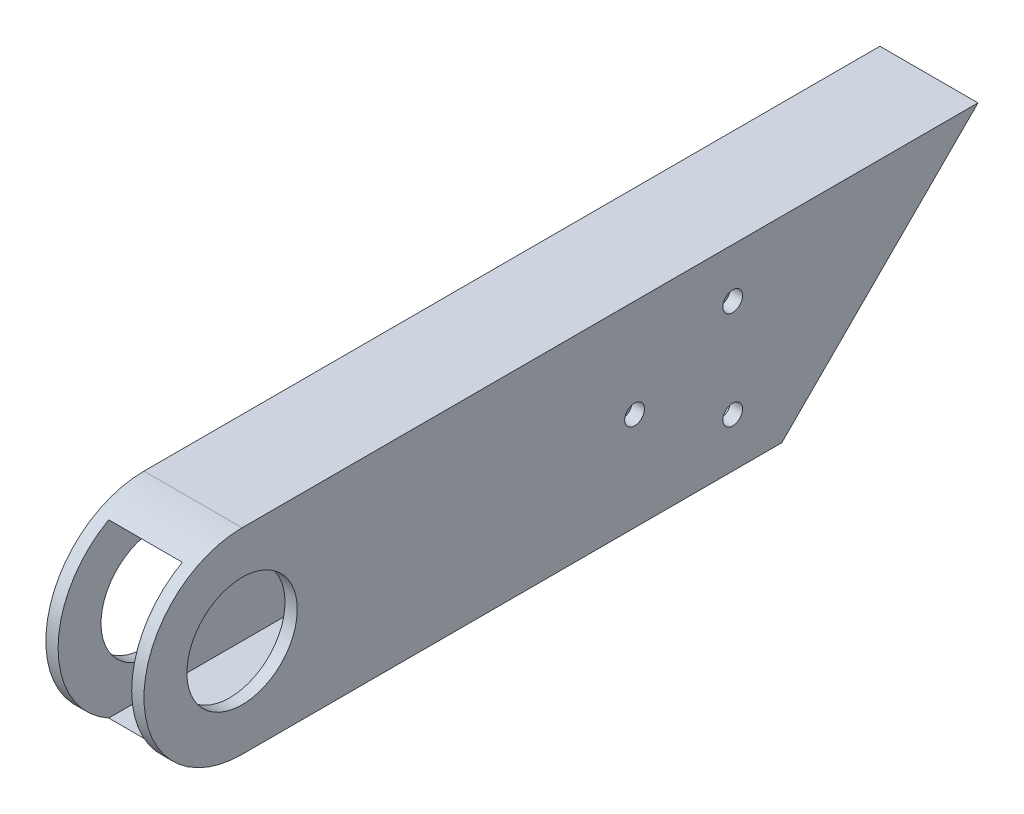
ISO-10303-21;
HEADER;
FILE_DESCRIPTION(('STEP AP214'),'2;1');
FILE_NAME('part.step','',(''),(''),'','','');
FILE_SCHEMA(('AUTOMOTIVE_DESIGN { 1 0 10303 214 1 1 1 1 }'));
ENDSEC;
DATA;
#1=APPLICATION_CONTEXT('core data for automotive mechanical design processes');
#2=APPLICATION_PROTOCOL_DEFINITION('international standard','automotive_design',2000,#1);
#3=PRODUCT_CONTEXT('',#1,'mechanical');
#4=PRODUCT('Part','Part','',(#3));
#5=PRODUCT_RELATED_PRODUCT_CATEGORY('part','',(#4));
#6=PRODUCT_DEFINITION_FORMATION('','',#4);
#7=PRODUCT_DEFINITION_CONTEXT('part definition',#1,'design');
#8=PRODUCT_DEFINITION('design','',#6,#7);
#9=PRODUCT_DEFINITION_SHAPE('','',#8);
#10=(LENGTH_UNIT() NAMED_UNIT(*) SI_UNIT(.MILLI.,.METRE.));
#11=(NAMED_UNIT(*) PLANE_ANGLE_UNIT() SI_UNIT($,.RADIAN.));
#12=(NAMED_UNIT(*) SI_UNIT($,.STERADIAN.) SOLID_ANGLE_UNIT());
#13=UNCERTAINTY_MEASURE_WITH_UNIT(LENGTH_MEASURE(1.E-05),#10,'distance_accuracy_value','');
#14=(GEOMETRIC_REPRESENTATION_CONTEXT(3) GLOBAL_UNCERTAINTY_ASSIGNED_CONTEXT((#13)) GLOBAL_UNIT_ASSIGNED_CONTEXT((#10,
#11,#12)) REPRESENTATION_CONTEXT('',''));
#15=CARTESIAN_POINT('',(0.,0.,0.));
#16=DIRECTION('',(0.,0.,1.));
#17=DIRECTION('',(1.,0.,0.));
#18=AXIS2_PLACEMENT_3D('',#15,#16,#17);
#19=CARTESIAN_POINT('',(-25.4,50.8,215.9));
#20=DIRECTION('',(1.,0.,0.));
#21=DIRECTION('',(0.,0.,-1.));
#22=AXIS2_PLACEMENT_3D('',#19,#20,#21);
#23=PLANE('',#22);
#24=CARTESIAN_POINT('',(-25.4,25.4,190.5));
#25=DIRECTION('',(1.,0.,0.));
#26=DIRECTION('',(0.,1.,0.));
#27=AXIS2_PLACEMENT_3D('',#24,#25,#26);
#28=CIRCLE('',#27,14.2875);
#29=CARTESIAN_POINT('',(-25.4,39.6875,190.5));
#30=VERTEX_POINT('',#29);
#31=EDGE_CURVE('E224',#30,#30,#28,.T.);
#32=ORIENTED_EDGE('',*,*,#31,.T.);
#33=EDGE_LOOP('',(#32));
#34=FACE_BOUND('',#33,.T.);
#35=CARTESIAN_POINT('',(-25.4,25.4,88.8999999999991));
#36=DIRECTION('',(1.,0.,0.));
#37=DIRECTION('',(0.,1.,0.));
#38=AXIS2_PLACEMENT_3D('',#35,#36,#37);
#39=CIRCLE('',#38,2.55270000000001);
#40=CARTESIAN_POINT('',(-25.4,27.9527,88.8999999999991));
#41=VERTEX_POINT('',#40);
#42=EDGE_CURVE('E140',#41,#41,#39,.T.);
#43=ORIENTED_EDGE('',*,*,#42,.T.);
#44=EDGE_LOOP('',(#43));
#45=FACE_BOUND('',#44,.T.);
#46=CARTESIAN_POINT('',(-25.4,12.7,63.4999999999991));
#47=DIRECTION('',(1.,0.,0.));
#48=DIRECTION('',(0.,1.,0.));
#49=AXIS2_PLACEMENT_3D('',#46,#47,#48);
#50=CIRCLE('',#49,2.55270000000001);
#51=CARTESIAN_POINT('',(-25.4,15.2527,63.4999999999991));
#52=VERTEX_POINT('',#51);
#53=EDGE_CURVE('E136',#52,#52,#50,.T.);
#54=ORIENTED_EDGE('',*,*,#53,.T.);
#55=EDGE_LOOP('',(#54));
#56=FACE_BOUND('',#55,.T.);
#57=CARTESIAN_POINT('',(-25.4,38.1,63.4999999999991));
#58=DIRECTION('',(1.,0.,0.));
#59=DIRECTION('',(0.,1.,0.));
#60=AXIS2_PLACEMENT_3D('',#57,#58,#59);
#61=CIRCLE('',#60,2.55270000000001);
#62=CARTESIAN_POINT('',(-25.4,40.6527,63.4999999999991));
#63=VERTEX_POINT('',#62);
#64=EDGE_CURVE('E131',#63,#63,#61,.T.);
#65=ORIENTED_EDGE('',*,*,#64,.T.);
#66=EDGE_LOOP('',(#65));
#67=FACE_BOUND('',#66,.T.);
#68=DIRECTION('',(0.,0.,-1.));
#69=VECTOR('',#68,1.);
#70=CARTESIAN_POINT('',(-25.4,0.,215.9));
#71=LINE('',#70,#69);
#72=CARTESIAN_POINT('',(-25.4,0.,190.5));
#73=VERTEX_POINT('',#72);
#74=CARTESIAN_POINT('',(-25.4,0.,50.7999999999991));
#75=VERTEX_POINT('',#74);
#76=EDGE_CURVE('E109',#73,#75,#71,.T.);
#77=ORIENTED_EDGE('',*,*,#76,.F.);
#78=CARTESIAN_POINT('',(-25.4,25.4,190.5));
#79=DIRECTION('',(-1.,0.,0.));
#80=DIRECTION('',(0.,-1.,0.));
#81=AXIS2_PLACEMENT_3D('',#78,#79,#80);
#82=CIRCLE('',#81,25.4);
#83=CARTESIAN_POINT('',(-25.4,50.8,190.5));
#84=VERTEX_POINT('',#83);
#85=EDGE_CURVE('E97',#73,#84,#82,.T.);
#86=ORIENTED_EDGE('',*,*,#85,.T.);
#87=DIRECTION('',(0.,0.,-1.));
#88=VECTOR('',#87,1.);
#89=CARTESIAN_POINT('',(-25.4,50.8,215.9));
#90=LINE('',#89,#88);
#91=CARTESIAN_POINT('',(-25.4,50.8,0.));
#92=VERTEX_POINT('',#91);
#93=EDGE_CURVE('E107',#84,#92,#90,.T.);
#94=ORIENTED_EDGE('',*,*,#93,.T.);
#95=DIRECTION('',(0.,-0.707106781186554,0.707106781186541));
#96=VECTOR('',#95,1.);
#97=CARTESIAN_POINT('',(-25.4,50.8,0.));
#98=LINE('',#97,#96);
#99=EDGE_CURVE('E171',#92,#75,#98,.T.);
#100=ORIENTED_EDGE('',*,*,#99,.T.);
#101=EDGE_LOOP('',(#77,#86,#94,#100));
#102=FACE_BOUND('',#101,.T.);
#103=ADVANCED_FACE('F33',(#34,#45,#56,#67,#102),#23,.F.);
#104=CARTESIAN_POINT('',(-25.4,0.,215.9));
#105=DIRECTION('',(0.,1.,0.));
#106=DIRECTION('',(0.,0.,1.));
#107=AXIS2_PLACEMENT_3D('',#104,#105,#106);
#108=PLANE('',#107);
#109=DIRECTION('',(1.,0.,0.));
#110=VECTOR('',#109,1.);
#111=CARTESIAN_POINT('',(-25.4,0.,190.5));
#112=LINE('',#111,#110);
#113=CARTESIAN_POINT('',(0.,0.,190.5));
#114=VERTEX_POINT('',#113);
#115=EDGE_CURVE('E102',#73,#114,#112,.T.);
#116=ORIENTED_EDGE('',*,*,#115,.F.);
#117=ORIENTED_EDGE('',*,*,#76,.T.);
#118=DIRECTION('',(1.,0.,0.));
#119=VECTOR('',#118,1.);
#120=CARTESIAN_POINT('',(-25.4,0.,50.7999999999991));
#121=LINE('',#120,#119);
#122=CARTESIAN_POINT('',(0.,0.,50.7999999999991));
#123=VERTEX_POINT('',#122);
#124=EDGE_CURVE('E173',#75,#123,#121,.T.);
#125=ORIENTED_EDGE('',*,*,#124,.T.);
#126=DIRECTION('',(0.,0.,-1.));
#127=VECTOR('',#126,1.);
#128=CARTESIAN_POINT('',(0.,0.,215.9));
#129=LINE('',#128,#127);
#130=EDGE_CURVE('E117',#114,#123,#129,.T.);
#131=ORIENTED_EDGE('',*,*,#130,.F.);
#132=EDGE_LOOP('',(#116,#117,#125,#131));
#133=FACE_BOUND('',#132,.T.);
#134=ADVANCED_FACE('F252',(#133),#108,.F.);
#135=CARTESIAN_POINT('',(0.,50.8,215.9));
#136=DIRECTION('',(-1.,0.,0.));
#137=DIRECTION('',(0.,-1.,0.));
#138=AXIS2_PLACEMENT_3D('',#135,#136,#137);
#139=PLANE('',#138);
#140=CARTESIAN_POINT('',(0.,25.4,190.5));
#141=DIRECTION('',(1.,0.,0.));
#142=DIRECTION('',(0.,1.,0.));
#143=AXIS2_PLACEMENT_3D('',#140,#141,#142);
#144=CIRCLE('',#143,14.2875);
#145=CARTESIAN_POINT('',(0.,39.6875,190.5));
#146=VERTEX_POINT('',#145);
#147=EDGE_CURVE('E221',#146,#146,#144,.T.);
#148=ORIENTED_EDGE('',*,*,#147,.F.);
#149=EDGE_LOOP('',(#148));
#150=FACE_BOUND('',#149,.T.);
#151=CARTESIAN_POINT('',(0.,25.4,88.8999999999991));
#152=DIRECTION('',(1.,0.,0.));
#153=DIRECTION('',(0.,1.,0.));
#154=AXIS2_PLACEMENT_3D('',#151,#152,#153);
#155=CIRCLE('',#154,2.55270000000001);
#156=CARTESIAN_POINT('',(0.,27.9527,88.8999999999991));
#157=VERTEX_POINT('',#156);
#158=EDGE_CURVE('E147',#157,#157,#155,.T.);
#159=ORIENTED_EDGE('',*,*,#158,.F.);
#160=EDGE_LOOP('',(#159));
#161=FACE_BOUND('',#160,.T.);
#162=CARTESIAN_POINT('',(0.,12.7,63.4999999999991));
#163=DIRECTION('',(1.,0.,0.));
#164=DIRECTION('',(0.,1.,0.));
#165=AXIS2_PLACEMENT_3D('',#162,#163,#164);
#166=CIRCLE('',#165,2.55270000000001);
#167=CARTESIAN_POINT('',(0.,15.2527,63.4999999999991));
#168=VERTEX_POINT('',#167);
#169=EDGE_CURVE('E144',#168,#168,#166,.T.);
#170=ORIENTED_EDGE('',*,*,#169,.F.);
#171=EDGE_LOOP('',(#170));
#172=FACE_BOUND('',#171,.T.);
#173=CARTESIAN_POINT('',(0.,38.1,63.4999999999991));
#174=DIRECTION('',(1.,0.,0.));
#175=DIRECTION('',(0.,1.,0.));
#176=AXIS2_PLACEMENT_3D('',#173,#174,#175);
#177=CIRCLE('',#176,2.55270000000001);
#178=CARTESIAN_POINT('',(0.,40.6527,63.4999999999991));
#179=VERTEX_POINT('',#178);
#180=EDGE_CURVE('E163',#179,#179,#177,.T.);
#181=ORIENTED_EDGE('',*,*,#180,.F.);
#182=EDGE_LOOP('',(#181));
#183=FACE_BOUND('',#182,.T.);
#184=DIRECTION('',(0.,0.,-1.));
#185=VECTOR('',#184,1.);
#186=CARTESIAN_POINT('',(0.,50.8,215.9));
#187=LINE('',#186,#185);
#188=CARTESIAN_POINT('',(0.,50.8,190.5));
#189=VERTEX_POINT('',#188);
#190=CARTESIAN_POINT('',(0.,50.8,0.));
#191=VERTEX_POINT('',#190);
#192=EDGE_CURVE('E115',#189,#191,#187,.T.);
#193=ORIENTED_EDGE('',*,*,#192,.F.);
#194=CARTESIAN_POINT('',(0.,25.4,190.5));
#195=DIRECTION('',(-1.,0.,0.));
#196=DIRECTION('',(0.,-1.,0.));
#197=AXIS2_PLACEMENT_3D('',#194,#195,#196);
#198=CIRCLE('',#197,25.4);
#199=EDGE_CURVE('E48',#114,#189,#198,.T.);
#200=ORIENTED_EDGE('',*,*,#199,.F.);
#201=ORIENTED_EDGE('',*,*,#130,.T.);
#202=DIRECTION('',(0.,-0.707106781186554,0.707106781186541));
#203=VECTOR('',#202,1.);
#204=CARTESIAN_POINT('',(0.,50.8,0.));
#205=LINE('',#204,#203);
#206=EDGE_CURVE('E170',#191,#123,#205,.T.);
#207=ORIENTED_EDGE('',*,*,#206,.F.);
#208=EDGE_LOOP('',(#193,#200,#201,#207));
#209=FACE_BOUND('',#208,.T.);
#210=ADVANCED_FACE('F249',(#150,#161,#172,#183,#209),#139,.F.);
#211=CARTESIAN_POINT('',(-25.4,50.8,215.9));
#212=DIRECTION('',(0.,-1.,0.));
#213=DIRECTION('',(0.,0.,-1.));
#214=AXIS2_PLACEMENT_3D('',#211,#212,#213);
#215=PLANE('',#214);
#216=DIRECTION('',(1.,0.,0.));
#217=VECTOR('',#216,1.);
#218=CARTESIAN_POINT('',(-25.4,50.8,190.5));
#219=LINE('',#218,#217);
#220=EDGE_CURVE('E94',#84,#189,#219,.T.);
#221=ORIENTED_EDGE('',*,*,#220,.T.);
#222=ORIENTED_EDGE('',*,*,#192,.T.);
#223=DIRECTION('',(-1.,0.,0.));
#224=VECTOR('',#223,1.);
#225=CARTESIAN_POINT('',(-25.4,50.8,0.));
#226=LINE('',#225,#224);
#227=EDGE_CURVE('E114',#191,#92,#226,.T.);
#228=ORIENTED_EDGE('',*,*,#227,.T.);
#229=ORIENTED_EDGE('',*,*,#93,.F.);
#230=EDGE_LOOP('',(#221,#222,#228,#229));
#231=FACE_BOUND('',#230,.T.);
#232=ADVANCED_FACE('F112',(#231),#215,.F.);
#233=CARTESIAN_POINT('',(-22.225,47.625,215.9));
#234=DIRECTION('',(1.,0.,0.));
#235=DIRECTION('',(0.,1.,0.));
#236=AXIS2_PLACEMENT_3D('',#233,#234,#235);
#237=PLANE('',#236);
#238=CARTESIAN_POINT('',(-22.225,25.4,190.5));
#239=DIRECTION('',(1.,0.,0.));
#240=DIRECTION('',(0.,1.,0.));
#241=AXIS2_PLACEMENT_3D('',#238,#239,#240);
#242=CIRCLE('',#241,14.2875);
#243=CARTESIAN_POINT('',(-22.225,39.6875,190.5));
#244=VERTEX_POINT('',#243);
#245=EDGE_CURVE('E217',#244,#244,#242,.T.);
#246=ORIENTED_EDGE('',*,*,#245,.F.);
#247=EDGE_LOOP('',(#246));
#248=FACE_BOUND('',#247,.T.);
#249=CARTESIAN_POINT('',(-22.225,25.4,88.8999999999991));
#250=DIRECTION('',(1.,0.,0.));
#251=DIRECTION('',(0.,1.,0.));
#252=AXIS2_PLACEMENT_3D('',#249,#250,#251);
#253=CIRCLE('',#252,2.55270000000001);
#254=CARTESIAN_POINT('',(-22.225,27.9527,88.8999999999991));
#255=VERTEX_POINT('',#254);
#256=EDGE_CURVE('E139',#255,#255,#253,.T.);
#257=ORIENTED_EDGE('',*,*,#256,.F.);
#258=EDGE_LOOP('',(#257));
#259=FACE_BOUND('',#258,.T.);
#260=CARTESIAN_POINT('',(-22.225,12.7,63.4999999999991));
#261=DIRECTION('',(1.,0.,0.));
#262=DIRECTION('',(0.,1.,0.));
#263=AXIS2_PLACEMENT_3D('',#260,#261,#262);
#264=CIRCLE('',#263,2.55270000000001);
#265=CARTESIAN_POINT('',(-22.225,15.2527,63.4999999999991));
#266=VERTEX_POINT('',#265);
#267=EDGE_CURVE('E135',#266,#266,#264,.T.);
#268=ORIENTED_EDGE('',*,*,#267,.F.);
#269=EDGE_LOOP('',(#268));
#270=FACE_BOUND('',#269,.T.);
#271=CARTESIAN_POINT('',(-22.225,38.1,63.4999999999991));
#272=DIRECTION('',(1.,0.,0.));
#273=DIRECTION('',(0.,1.,0.));
#274=AXIS2_PLACEMENT_3D('',#271,#272,#273);
#275=CIRCLE('',#274,2.55270000000001);
#276=CARTESIAN_POINT('',(-22.225,40.6527,63.4999999999991));
#277=VERTEX_POINT('',#276);
#278=EDGE_CURVE('E130',#277,#277,#275,.T.);
#279=ORIENTED_EDGE('',*,*,#278,.F.);
#280=EDGE_LOOP('',(#279));
#281=FACE_BOUND('',#280,.T.);
#282=CARTESIAN_POINT('',(-22.225,25.4,190.5));
#283=DIRECTION('',(1.,0.,0.));
#284=DIRECTION('',(0.,1.,0.));
#285=AXIS2_PLACEMENT_3D('',#282,#283,#284);
#286=CIRCLE('',#285,25.4);
#287=CARTESIAN_POINT('',(-22.225,3.175,202.796722124209));
#288=VERTEX_POINT('',#287);
#289=CARTESIAN_POINT('',(-22.225,47.625,202.796722124209));
#290=VERTEX_POINT('',#289);
#291=EDGE_CURVE('E55',#288,#290,#286,.F.);
#292=ORIENTED_EDGE('',*,*,#291,.F.);
#293=DIRECTION('',(0.,0.,-1.));
#294=VECTOR('',#293,1.);
#295=CARTESIAN_POINT('',(-22.225,3.175,215.9));
#296=LINE('',#295,#294);
#297=CARTESIAN_POINT('',(-22.225,3.175,47.6249999999992));
#298=VERTEX_POINT('',#297);
#299=EDGE_CURVE('E119',#288,#298,#296,.T.);
#300=ORIENTED_EDGE('',*,*,#299,.T.);
#301=DIRECTION('',(0.,-0.707106781186554,0.707106781186541));
#302=VECTOR('',#301,1.);
#303=CARTESIAN_POINT('',(-22.225,-58.7375,109.537499999998));
#304=LINE('',#303,#302);
#305=CARTESIAN_POINT('',(-22.225,47.625,3.17499999999996));
#306=VERTEX_POINT('',#305);
#307=EDGE_CURVE('E184',#306,#298,#304,.T.);
#308=ORIENTED_EDGE('',*,*,#307,.F.);
#309=DIRECTION('',(0.,0.,-1.));
#310=VECTOR('',#309,1.);
#311=CARTESIAN_POINT('',(-22.225,47.625,215.9));
#312=LINE('',#311,#310);
#313=EDGE_CURVE('E187',#290,#306,#312,.T.);
#314=ORIENTED_EDGE('',*,*,#313,.F.);
#315=EDGE_LOOP('',(#292,#300,#308,#314));
#316=FACE_BOUND('',#315,.T.);
#317=ADVANCED_FACE('F195',(#248,#259,#270,#281,#316),#237,.T.);
#318=CARTESIAN_POINT('',(-3.175,47.625,215.9));
#319=DIRECTION('',(-1.,0.,0.));
#320=DIRECTION('',(0.,-1.,0.));
#321=AXIS2_PLACEMENT_3D('',#318,#319,#320);
#322=PLANE('',#321);
#323=CARTESIAN_POINT('',(-3.175,25.4,190.5));
#324=DIRECTION('',(-1.,0.,0.));
#325=DIRECTION('',(0.,-1.,0.));
#326=AXIS2_PLACEMENT_3D('',#323,#324,#325);
#327=CIRCLE('',#326,14.2875);
#328=CARTESIAN_POINT('',(-3.17499999999999,11.1125,190.5));
#329=VERTEX_POINT('',#328);
#330=EDGE_CURVE('E36',#329,#329,#327,.T.);
#331=ORIENTED_EDGE('',*,*,#330,.F.);
#332=EDGE_LOOP('',(#331));
#333=FACE_BOUND('',#332,.T.);
#334=CARTESIAN_POINT('',(-3.175,25.4,88.8999999999991));
#335=DIRECTION('',(-1.,0.,0.));
#336=DIRECTION('',(0.,-1.,0.));
#337=AXIS2_PLACEMENT_3D('',#334,#335,#336);
#338=CIRCLE('',#337,2.55270000000001);
#339=CARTESIAN_POINT('',(-3.175,22.8473,88.8999999999991));
#340=VERTEX_POINT('',#339);
#341=EDGE_CURVE('E137',#340,#340,#338,.T.);
#342=ORIENTED_EDGE('',*,*,#341,.F.);
#343=EDGE_LOOP('',(#342));
#344=FACE_BOUND('',#343,.T.);
#345=CARTESIAN_POINT('',(-3.17499999999999,12.7,63.4999999999991));
#346=DIRECTION('',(-1.,0.,0.));
#347=DIRECTION('',(0.,-1.,0.));
#348=AXIS2_PLACEMENT_3D('',#345,#346,#347);
#349=CIRCLE('',#348,2.55270000000001);
#350=CARTESIAN_POINT('',(-3.17499999999999,10.1473,63.4999999999991));
#351=VERTEX_POINT('',#350);
#352=EDGE_CURVE('E132',#351,#351,#349,.T.);
#353=ORIENTED_EDGE('',*,*,#352,.F.);
#354=EDGE_LOOP('',(#353));
#355=FACE_BOUND('',#354,.T.);
#356=CARTESIAN_POINT('',(-3.175,38.1,63.4999999999991));
#357=DIRECTION('',(-1.,0.,0.));
#358=DIRECTION('',(0.,-1.,0.));
#359=AXIS2_PLACEMENT_3D('',#356,#357,#358);
#360=CIRCLE('',#359,2.55270000000001);
#361=CARTESIAN_POINT('',(-3.175,35.5473,63.4999999999991));
#362=VERTEX_POINT('',#361);
#363=EDGE_CURVE('E127',#362,#362,#360,.T.);
#364=ORIENTED_EDGE('',*,*,#363,.F.);
#365=EDGE_LOOP('',(#364));
#366=FACE_BOUND('',#365,.T.);
#367=CARTESIAN_POINT('',(-3.175,25.4,190.5));
#368=DIRECTION('',(-1.,0.,0.));
#369=DIRECTION('',(0.,-1.,0.));
#370=AXIS2_PLACEMENT_3D('',#367,#368,#369);
#371=CIRCLE('',#370,25.4);
#372=CARTESIAN_POINT('',(-3.175,47.625,202.796722124209));
#373=VERTEX_POINT('',#372);
#374=CARTESIAN_POINT('',(-3.17499999999999,3.175,202.796722124209));
#375=VERTEX_POINT('',#374);
#376=EDGE_CURVE('E210',#373,#375,#371,.F.);
#377=ORIENTED_EDGE('',*,*,#376,.F.);
#378=DIRECTION('',(0.,0.,-1.));
#379=VECTOR('',#378,1.);
#380=CARTESIAN_POINT('',(-3.175,47.625,215.9));
#381=LINE('',#380,#379);
#382=CARTESIAN_POINT('',(-3.175,47.625,3.17499999999996));
#383=VERTEX_POINT('',#382);
#384=EDGE_CURVE('E189',#373,#383,#381,.T.);
#385=ORIENTED_EDGE('',*,*,#384,.T.);
#386=DIRECTION('',(0.,0.707106781186554,-0.707106781186541));
#387=VECTOR('',#386,1.);
#388=CARTESIAN_POINT('',(-3.17499999999998,-58.7375,109.537499999998));
#389=LINE('',#388,#387);
#390=CARTESIAN_POINT('',(-3.17499999999999,3.175,47.6249999999992));
#391=VERTEX_POINT('',#390);
#392=EDGE_CURVE('E178',#391,#383,#389,.T.);
#393=ORIENTED_EDGE('',*,*,#392,.F.);
#394=DIRECTION('',(0.,0.,-1.));
#395=VECTOR('',#394,1.);
#396=CARTESIAN_POINT('',(-3.17499999999999,3.175,215.9));
#397=LINE('',#396,#395);
#398=EDGE_CURVE('E191',#375,#391,#397,.T.);
#399=ORIENTED_EDGE('',*,*,#398,.F.);
#400=EDGE_LOOP('',(#377,#385,#393,#399));
#401=FACE_BOUND('',#400,.T.);
#402=ADVANCED_FACE('F209',(#333,#344,#355,#366,#401),#322,.T.);
#403=CARTESIAN_POINT('',(-22.225,3.175,215.9));
#404=DIRECTION('',(0.,1.,0.));
#405=DIRECTION('',(0.,0.,1.));
#406=AXIS2_PLACEMENT_3D('',#403,#404,#405);
#407=PLANE('',#406);
#408=DIRECTION('',(1.,0.,0.));
#409=VECTOR('',#408,1.);
#410=CARTESIAN_POINT('',(-25.4,3.175,202.796722124209));
#411=LINE('',#410,#409);
#412=EDGE_CURVE('E152',#375,#288,#411,.F.);
#413=ORIENTED_EDGE('',*,*,#412,.F.);
#414=ORIENTED_EDGE('',*,*,#398,.T.);
#415=DIRECTION('',(1.,0.,0.));
#416=VECTOR('',#415,1.);
#417=CARTESIAN_POINT('',(-22.225,3.175,47.6249999999992));
#418=LINE('',#417,#416);
#419=EDGE_CURVE('E181',#298,#391,#418,.T.);
#420=ORIENTED_EDGE('',*,*,#419,.F.);
#421=ORIENTED_EDGE('',*,*,#299,.F.);
#422=EDGE_LOOP('',(#413,#414,#420,#421));
#423=FACE_BOUND('',#422,.T.);
#424=ADVANCED_FACE('F205',(#423),#407,.T.);
#425=CARTESIAN_POINT('',(-22.225,47.625,215.9));
#426=DIRECTION('',(0.,-1.,0.));
#427=DIRECTION('',(0.,0.,-1.));
#428=AXIS2_PLACEMENT_3D('',#425,#426,#427);
#429=PLANE('',#428);
#430=DIRECTION('',(1.,0.,0.));
#431=VECTOR('',#430,1.);
#432=CARTESIAN_POINT('',(-25.4,47.625,202.796722124209));
#433=LINE('',#432,#431);
#434=EDGE_CURVE('E11',#290,#373,#433,.T.);
#435=ORIENTED_EDGE('',*,*,#434,.F.);
#436=ORIENTED_EDGE('',*,*,#313,.T.);
#437=DIRECTION('',(-1.,0.,0.));
#438=VECTOR('',#437,1.);
#439=CARTESIAN_POINT('',(-22.225,47.625,3.17499999999996));
#440=LINE('',#439,#438);
#441=EDGE_CURVE('E41',#383,#306,#440,.T.);
#442=ORIENTED_EDGE('',*,*,#441,.F.);
#443=ORIENTED_EDGE('',*,*,#384,.F.);
#444=EDGE_LOOP('',(#435,#436,#442,#443));
#445=FACE_BOUND('',#444,.T.);
#446=ADVANCED_FACE('F213',(#445),#429,.T.);
#447=CARTESIAN_POINT('',(-25.4,50.8,0.));
#448=DIRECTION('',(0.,0.707106781186541,0.707106781186554));
#449=DIRECTION('',(0.,-0.707106781186554,0.707106781186541));
#450=AXIS2_PLACEMENT_3D('',#447,#448,#449);
#451=PLANE('',#450);
#452=ORIENTED_EDGE('',*,*,#307,.T.);
#453=ORIENTED_EDGE('',*,*,#419,.T.);
#454=ORIENTED_EDGE('',*,*,#392,.T.);
#455=ORIENTED_EDGE('',*,*,#441,.T.);
#456=EDGE_LOOP('',(#452,#453,#454,#455));
#457=FACE_BOUND('',#456,.T.);
#458=ORIENTED_EDGE('',*,*,#206,.T.);
#459=ORIENTED_EDGE('',*,*,#124,.F.);
#460=ORIENTED_EDGE('',*,*,#99,.F.);
#461=ORIENTED_EDGE('',*,*,#227,.F.);
#462=EDGE_LOOP('',(#458,#459,#460,#461));
#463=FACE_BOUND('',#462,.T.);
#464=ADVANCED_FACE('F201',(#457,#463),#451,.F.);
#465=CARTESIAN_POINT('',(-25.4,38.1,63.4999999999991));
#466=DIRECTION('',(1.,0.,0.));
#467=DIRECTION('',(0.,1.,0.));
#468=AXIS2_PLACEMENT_3D('',#465,#466,#467);
#469=CYLINDRICAL_SURFACE('',#468,2.55270000000001);
#470=ORIENTED_EDGE('',*,*,#363,.T.);
#471=EDGE_LOOP('',(#470));
#472=FACE_BOUND('',#471,.T.);
#473=ORIENTED_EDGE('',*,*,#180,.T.);
#474=EDGE_LOOP('',(#473));
#475=FACE_BOUND('',#474,.T.);
#476=ADVANCED_FACE('F242',(#472,#475),#469,.F.);
#477=ORIENTED_EDGE('',*,*,#278,.T.);
#478=EDGE_LOOP('',(#477));
#479=FACE_BOUND('',#478,.T.);
#480=ORIENTED_EDGE('',*,*,#64,.F.);
#481=EDGE_LOOP('',(#480));
#482=FACE_BOUND('',#481,.T.);
#483=ADVANCED_FACE('F245',(#479,#482),#469,.F.);
#484=CARTESIAN_POINT('',(-25.4,12.7,63.4999999999991));
#485=DIRECTION('',(1.,0.,0.));
#486=DIRECTION('',(0.,1.,0.));
#487=AXIS2_PLACEMENT_3D('',#484,#485,#486);
#488=CYLINDRICAL_SURFACE('',#487,2.55270000000001);
#489=ORIENTED_EDGE('',*,*,#352,.T.);
#490=EDGE_LOOP('',(#489));
#491=FACE_BOUND('',#490,.T.);
#492=ORIENTED_EDGE('',*,*,#169,.T.);
#493=EDGE_LOOP('',(#492));
#494=FACE_BOUND('',#493,.T.);
#495=ADVANCED_FACE('F276',(#491,#494),#488,.F.);
#496=ORIENTED_EDGE('',*,*,#267,.T.);
#497=EDGE_LOOP('',(#496));
#498=FACE_BOUND('',#497,.T.);
#499=ORIENTED_EDGE('',*,*,#53,.F.);
#500=EDGE_LOOP('',(#499));
#501=FACE_BOUND('',#500,.T.);
#502=ADVANCED_FACE('F279',(#498,#501),#488,.F.);
#503=CARTESIAN_POINT('',(-25.4,25.4,88.8999999999991));
#504=DIRECTION('',(1.,0.,0.));
#505=DIRECTION('',(0.,1.,0.));
#506=AXIS2_PLACEMENT_3D('',#503,#504,#505);
#507=CYLINDRICAL_SURFACE('',#506,2.55270000000001);
#508=ORIENTED_EDGE('',*,*,#341,.T.);
#509=EDGE_LOOP('',(#508));
#510=FACE_BOUND('',#509,.T.);
#511=ORIENTED_EDGE('',*,*,#158,.T.);
#512=EDGE_LOOP('',(#511));
#513=FACE_BOUND('',#512,.T.);
#514=ADVANCED_FACE('F281',(#510,#513),#507,.F.);
#515=ORIENTED_EDGE('',*,*,#256,.T.);
#516=EDGE_LOOP('',(#515));
#517=FACE_BOUND('',#516,.T.);
#518=ORIENTED_EDGE('',*,*,#42,.F.);
#519=EDGE_LOOP('',(#518));
#520=FACE_BOUND('',#519,.T.);
#521=ADVANCED_FACE('F284',(#517,#520),#507,.F.);
#522=CARTESIAN_POINT('',(-25.4,25.4,190.5));
#523=DIRECTION('',(1.,0.,0.));
#524=DIRECTION('',(0.,1.,0.));
#525=AXIS2_PLACEMENT_3D('',#522,#523,#524);
#526=CYLINDRICAL_SURFACE('',#525,25.4);
#527=ORIENTED_EDGE('',*,*,#376,.T.);
#528=ORIENTED_EDGE('',*,*,#412,.T.);
#529=ORIENTED_EDGE('',*,*,#291,.T.);
#530=ORIENTED_EDGE('',*,*,#434,.T.);
#531=EDGE_LOOP('',(#527,#528,#529,#530));
#532=FACE_BOUND('',#531,.T.);
#533=ORIENTED_EDGE('',*,*,#199,.T.);
#534=ORIENTED_EDGE('',*,*,#220,.F.);
#535=ORIENTED_EDGE('',*,*,#85,.F.);
#536=ORIENTED_EDGE('',*,*,#115,.T.);
#537=EDGE_LOOP('',(#533,#534,#535,#536));
#538=FACE_BOUND('',#537,.T.);
#539=ADVANCED_FACE('F96',(#532,#538),#526,.T.);
#540=CARTESIAN_POINT('',(-25.4,25.4,190.5));
#541=DIRECTION('',(1.,0.,0.));
#542=DIRECTION('',(0.,1.,0.));
#543=AXIS2_PLACEMENT_3D('',#540,#541,#542);
#544=CYLINDRICAL_SURFACE('',#543,14.2875);
#545=ORIENTED_EDGE('',*,*,#330,.T.);
#546=EDGE_LOOP('',(#545));
#547=FACE_BOUND('',#546,.T.);
#548=ORIENTED_EDGE('',*,*,#147,.T.);
#549=EDGE_LOOP('',(#548));
#550=FACE_BOUND('',#549,.T.);
#551=ADVANCED_FACE('F231',(#547,#550),#544,.F.);
#552=ORIENTED_EDGE('',*,*,#245,.T.);
#553=EDGE_LOOP('',(#552));
#554=FACE_BOUND('',#553,.T.);
#555=ORIENTED_EDGE('',*,*,#31,.F.);
#556=EDGE_LOOP('',(#555));
#557=FACE_BOUND('',#556,.T.);
#558=ADVANCED_FACE('F288',(#554,#557),#544,.F.);
#559=CLOSED_SHELL('',(#103,#134,#210,#232,#317,#402,#424,#446,#464,#476,#483,#495,#502,#514,
#521,#539,#551,#558));
#560=MANIFOLD_SOLID_BREP('B2',#559);
#561=ADVANCED_BREP_SHAPE_REPRESENTATION('',(#18,#560),#14);
#562=SHAPE_DEFINITION_REPRESENTATION(#9,#561);
ENDSEC;
END-ISO-10303-21;
